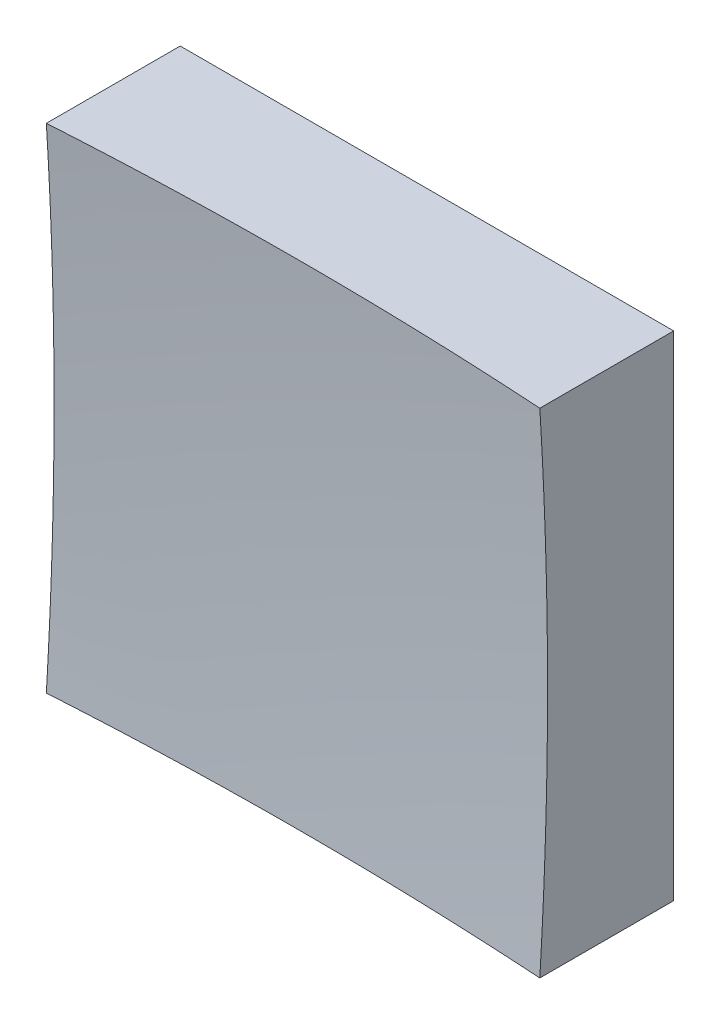
ISO-10303-21;
HEADER;
FILE_DESCRIPTION(('STEP AP214'),'2;1');
FILE_NAME('part.step','',(''),(''),'','','');
FILE_SCHEMA(('AUTOMOTIVE_DESIGN { 1 0 10303 214 1 1 1 1 }'));
ENDSEC;
DATA;
#1=APPLICATION_CONTEXT('core data for automotive mechanical design processes');
#2=APPLICATION_PROTOCOL_DEFINITION('international standard','automotive_design',2000,#1);
#3=PRODUCT_CONTEXT('',#1,'mechanical');
#4=PRODUCT('Part','Part','',(#3));
#5=PRODUCT_RELATED_PRODUCT_CATEGORY('part','',(#4));
#6=PRODUCT_DEFINITION_FORMATION('','',#4);
#7=PRODUCT_DEFINITION_CONTEXT('part definition',#1,'design');
#8=PRODUCT_DEFINITION('design','',#6,#7);
#9=PRODUCT_DEFINITION_SHAPE('','',#8);
#10=(LENGTH_UNIT() NAMED_UNIT(*) SI_UNIT(.MILLI.,.METRE.));
#11=(NAMED_UNIT(*) PLANE_ANGLE_UNIT() SI_UNIT($,.RADIAN.));
#12=(NAMED_UNIT(*) SI_UNIT($,.STERADIAN.) SOLID_ANGLE_UNIT());
#13=UNCERTAINTY_MEASURE_WITH_UNIT(LENGTH_MEASURE(1.E-05),#10,'distance_accuracy_value','');
#14=(GEOMETRIC_REPRESENTATION_CONTEXT(3) GLOBAL_UNCERTAINTY_ASSIGNED_CONTEXT((#13)) GLOBAL_UNIT_ASSIGNED_CONTEXT((#10,
#11,#12)) REPRESENTATION_CONTEXT('',''));
#15=CARTESIAN_POINT('',(0.,0.,0.));
#16=DIRECTION('',(0.,0.,1.));
#17=DIRECTION('',(1.,0.,0.));
#18=AXIS2_PLACEMENT_3D('',#15,#16,#17);
#19=CARTESIAN_POINT('',(-6.25,6.25,10.));
#20=DIRECTION('',(0.,1.,0.));
#21=DIRECTION('',(0.,0.,1.));
#22=AXIS2_PLACEMENT_3D('',#19,#20,#21);
#23=PLANE('',#22);
#24=CARTESIAN_POINT('',(0.,6.25,103.));
#25=DIRECTION('',(0.,1.,0.));
#26=DIRECTION('',(0.,0.,1.));
#27=AXIS2_PLACEMENT_3D('',#24,#25,#26);
#28=CIRCLE('',#27,99.8044963916957);
#29=CARTESIAN_POINT('',(6.25,6.25,3.39139093431733));
#30=VERTEX_POINT('',#29);
#31=CARTESIAN_POINT('',(-6.25,6.25,3.39139093431733));
#32=VERTEX_POINT('',#31);
#33=EDGE_CURVE('E79',#30,#32,#28,.T.);
#34=ORIENTED_EDGE('',*,*,#33,.F.);
#35=DIRECTION('',(0.,0.,-1.));
#36=VECTOR('',#35,1.);
#37=CARTESIAN_POINT('',(6.25,6.25,10.));
#38=LINE('',#37,#36);
#39=CARTESIAN_POINT('',(6.25,6.25,0.));
#40=VERTEX_POINT('',#39);
#41=EDGE_CURVE('E85',#30,#40,#38,.T.);
#42=ORIENTED_EDGE('',*,*,#41,.T.);
#43=DIRECTION('',(1.,0.,0.));
#44=VECTOR('',#43,1.);
#45=CARTESIAN_POINT('',(-6.25,6.25,0.));
#46=LINE('',#45,#44);
#47=CARTESIAN_POINT('',(-6.25,6.25,0.));
#48=VERTEX_POINT('',#47);
#49=EDGE_CURVE('E88',#48,#40,#46,.T.);
#50=ORIENTED_EDGE('',*,*,#49,.F.);
#51=DIRECTION('',(0.,0.,-1.));
#52=VECTOR('',#51,1.);
#53=CARTESIAN_POINT('',(-6.25,6.25,10.));
#54=LINE('',#53,#52);
#55=EDGE_CURVE('E47',#32,#48,#54,.T.);
#56=ORIENTED_EDGE('',*,*,#55,.F.);
#57=EDGE_LOOP('',(#34,#42,#50,#56));
#58=FACE_BOUND('',#57,.T.);
#59=ADVANCED_FACE('F39',(#58),#23,.T.);
#60=CARTESIAN_POINT('',(-6.25,6.25,10.));
#61=DIRECTION('',(1.,0.,0.));
#62=DIRECTION('',(0.,0.,-1.));
#63=AXIS2_PLACEMENT_3D('',#60,#61,#62);
#64=PLANE('',#63);
#65=DIRECTION('',(0.,0.,-1.));
#66=VECTOR('',#65,1.);
#67=CARTESIAN_POINT('',(-6.25,-6.25,10.));
#68=LINE('',#67,#66);
#69=CARTESIAN_POINT('',(-6.25,-6.25,3.39139093431733));
#70=VERTEX_POINT('',#69);
#71=CARTESIAN_POINT('',(-6.25,-6.25,0.));
#72=VERTEX_POINT('',#71);
#73=EDGE_CURVE('E100',#70,#72,#68,.T.);
#74=ORIENTED_EDGE('',*,*,#73,.F.);
#75=CARTESIAN_POINT('',(-6.25,0.,103.));
#76=DIRECTION('',(1.,0.,0.));
#77=DIRECTION('',(0.,0.,-1.));
#78=AXIS2_PLACEMENT_3D('',#75,#76,#77);
#79=CIRCLE('',#78,99.8044963916957);
#80=EDGE_CURVE('E89',#70,#32,#79,.T.);
#81=ORIENTED_EDGE('',*,*,#80,.T.);
#82=ORIENTED_EDGE('',*,*,#55,.T.);
#83=DIRECTION('',(0.,-1.,0.));
#84=VECTOR('',#83,1.);
#85=CARTESIAN_POINT('',(-6.25,6.25,0.));
#86=LINE('',#85,#84);
#87=EDGE_CURVE('E97',#48,#72,#86,.T.);
#88=ORIENTED_EDGE('',*,*,#87,.T.);
#89=EDGE_LOOP('',(#74,#81,#82,#88));
#90=FACE_BOUND('',#89,.T.);
#91=ADVANCED_FACE('F122',(#90),#64,.F.);
#92=CARTESIAN_POINT('',(-6.25,-6.25,10.));
#93=DIRECTION('',(0.,1.,0.));
#94=DIRECTION('',(0.,0.,1.));
#95=AXIS2_PLACEMENT_3D('',#92,#93,#94);
#96=PLANE('',#95);
#97=DIRECTION('',(0.,0.,-1.));
#98=VECTOR('',#97,1.);
#99=CARTESIAN_POINT('',(6.25,-6.25,10.));
#100=LINE('',#99,#98);
#101=CARTESIAN_POINT('',(6.25,-6.25,3.39139093431733));
#102=VERTEX_POINT('',#101);
#103=CARTESIAN_POINT('',(6.25,-6.25,0.));
#104=VERTEX_POINT('',#103);
#105=EDGE_CURVE('E96',#102,#104,#100,.T.);
#106=ORIENTED_EDGE('',*,*,#105,.F.);
#107=CARTESIAN_POINT('',(0.,-6.25,103.));
#108=DIRECTION('',(0.,1.,0.));
#109=DIRECTION('',(0.,0.,1.));
#110=AXIS2_PLACEMENT_3D('',#107,#108,#109);
#111=CIRCLE('',#110,99.8044963916957);
#112=EDGE_CURVE('E53',#102,#70,#111,.T.);
#113=ORIENTED_EDGE('',*,*,#112,.T.);
#114=ORIENTED_EDGE('',*,*,#73,.T.);
#115=DIRECTION('',(1.,0.,0.));
#116=VECTOR('',#115,1.);
#117=CARTESIAN_POINT('',(-6.25,-6.25,0.));
#118=LINE('',#117,#116);
#119=EDGE_CURVE('E102',#72,#104,#118,.T.);
#120=ORIENTED_EDGE('',*,*,#119,.T.);
#121=EDGE_LOOP('',(#106,#113,#114,#120));
#122=FACE_BOUND('',#121,.T.);
#123=ADVANCED_FACE('F121',(#122),#96,.F.);
#124=CARTESIAN_POINT('',(6.25,6.25,10.));
#125=DIRECTION('',(1.,0.,0.));
#126=DIRECTION('',(0.,0.,-1.));
#127=AXIS2_PLACEMENT_3D('',#124,#125,#126);
#128=PLANE('',#127);
#129=CARTESIAN_POINT('',(6.25,0.,103.));
#130=DIRECTION('',(1.,0.,0.));
#131=DIRECTION('',(0.,0.,-1.));
#132=AXIS2_PLACEMENT_3D('',#129,#130,#131);
#133=CIRCLE('',#132,99.8044963916957);
#134=EDGE_CURVE('E11',#102,#30,#133,.T.);
#135=ORIENTED_EDGE('',*,*,#134,.F.);
#136=ORIENTED_EDGE('',*,*,#105,.T.);
#137=DIRECTION('',(0.,-1.,0.));
#138=VECTOR('',#137,1.);
#139=CARTESIAN_POINT('',(6.25,6.25,0.));
#140=LINE('',#139,#138);
#141=EDGE_CURVE('E93',#40,#104,#140,.T.);
#142=ORIENTED_EDGE('',*,*,#141,.F.);
#143=ORIENTED_EDGE('',*,*,#41,.F.);
#144=EDGE_LOOP('',(#135,#136,#142,#143));
#145=FACE_BOUND('',#144,.T.);
#146=ADVANCED_FACE('F91',(#145),#128,.T.);
#147=CARTESIAN_POINT('',(0.,0.,0.));
#148=DIRECTION('',(0.,0.,-1.));
#149=DIRECTION('',(-1.,0.,0.));
#150=AXIS2_PLACEMENT_3D('',#147,#148,#149);
#151=PLANE('',#150);
#152=ORIENTED_EDGE('',*,*,#49,.T.);
#153=ORIENTED_EDGE('',*,*,#141,.T.);
#154=ORIENTED_EDGE('',*,*,#119,.F.);
#155=ORIENTED_EDGE('',*,*,#87,.F.);
#156=EDGE_LOOP('',(#152,#153,#154,#155));
#157=FACE_BOUND('',#156,.T.);
#158=ADVANCED_FACE('F125',(#157),#151,.T.);
#159=CARTESIAN_POINT('',(0.,0.,103.));
#160=DIRECTION('',(0.,0.,1.));
#161=DIRECTION('',(1.,0.,0.));
#162=AXIS2_PLACEMENT_3D('',#159,#160,#161);
#163=SPHERICAL_SURFACE('',#162,100.);
#164=ORIENTED_EDGE('',*,*,#33,.T.);
#165=ORIENTED_EDGE('',*,*,#80,.F.);
#166=ORIENTED_EDGE('',*,*,#112,.F.);
#167=ORIENTED_EDGE('',*,*,#134,.T.);
#168=EDGE_LOOP('',(#164,#165,#166,#167));
#169=FACE_BOUND('',#168,.T.);
#170=ADVANCED_FACE('F78',(#169),#163,.F.);
#171=CLOSED_SHELL('',(#59,#91,#123,#146,#158,#170));
#172=MANIFOLD_SOLID_BREP('B2',#171);
#173=ADVANCED_BREP_SHAPE_REPRESENTATION('',(#18,#172),#14);
#174=SHAPE_DEFINITION_REPRESENTATION(#9,#173);
ENDSEC;
END-ISO-10303-21;
